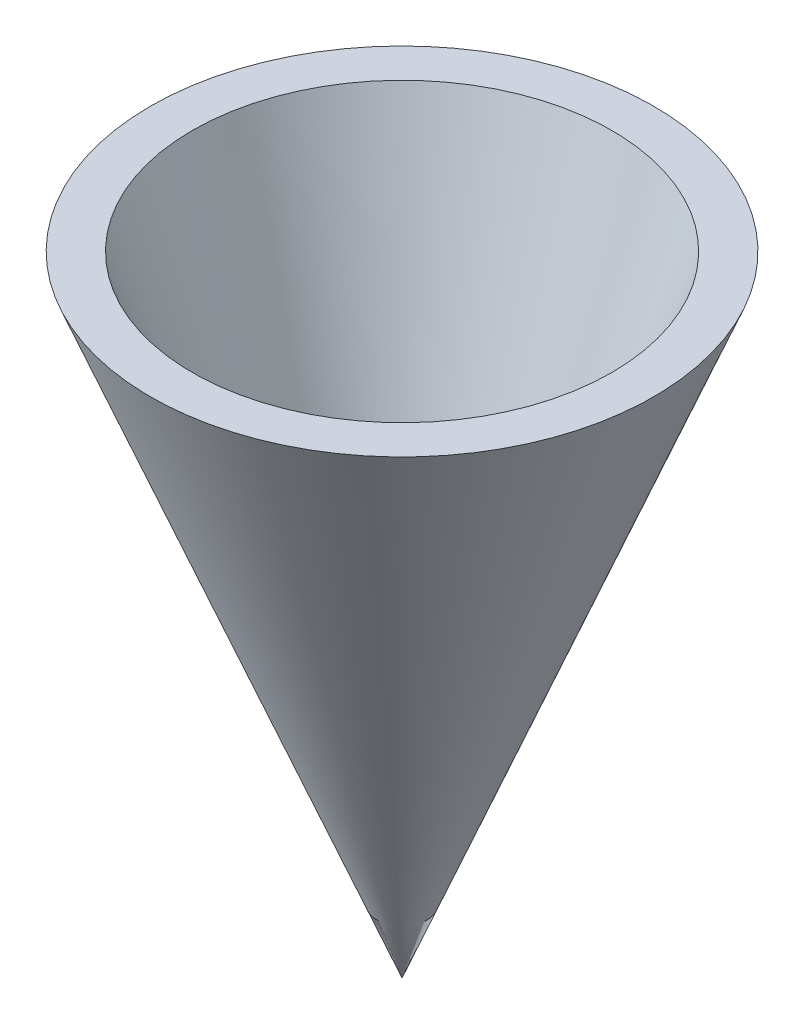
ISO-10303-21;
HEADER;
FILE_DESCRIPTION(('STEP AP214'),'2;1');
FILE_NAME('part.step','',(''),(''),'','','');
FILE_SCHEMA(('AUTOMOTIVE_DESIGN { 1 0 10303 214 1 1 1 1 }'));
ENDSEC;
DATA;
#1=APPLICATION_CONTEXT('core data for automotive mechanical design processes');
#2=APPLICATION_PROTOCOL_DEFINITION('international standard','automotive_design',2000,#1);
#3=PRODUCT_CONTEXT('',#1,'mechanical');
#4=PRODUCT('Part','Part','',(#3));
#5=PRODUCT_RELATED_PRODUCT_CATEGORY('part','',(#4));
#6=PRODUCT_DEFINITION_FORMATION('','',#4);
#7=PRODUCT_DEFINITION_CONTEXT('part definition',#1,'design');
#8=PRODUCT_DEFINITION('design','',#6,#7);
#9=PRODUCT_DEFINITION_SHAPE('','',#8);
#10=(LENGTH_UNIT() NAMED_UNIT(*) SI_UNIT(.MILLI.,.METRE.));
#11=(NAMED_UNIT(*) PLANE_ANGLE_UNIT() SI_UNIT($,.RADIAN.));
#12=(NAMED_UNIT(*) SI_UNIT($,.STERADIAN.) SOLID_ANGLE_UNIT());
#13=UNCERTAINTY_MEASURE_WITH_UNIT(LENGTH_MEASURE(1.E-05),#10,'distance_accuracy_value','');
#14=(GEOMETRIC_REPRESENTATION_CONTEXT(3) GLOBAL_UNCERTAINTY_ASSIGNED_CONTEXT((#13)) GLOBAL_UNIT_ASSIGNED_CONTEXT((#10,
#11,#12)) REPRESENTATION_CONTEXT('',''));
#15=CARTESIAN_POINT('',(0.,0.,0.));
#16=DIRECTION('',(0.,0.,1.));
#17=DIRECTION('',(1.,0.,0.));
#18=AXIS2_PLACEMENT_3D('',#15,#16,#17);
#19=CARTESIAN_POINT('',(0.,0.,0.));
#20=DIRECTION('',(0.,1.,0.));
#21=DIRECTION('',(-1.,0.,0.));
#22=AXIS2_PLACEMENT_3D('',#19,#20,#21);
#23=CONICAL_SURFACE('',#22,12.,0.380506377112365);
#24=CARTESIAN_POINT('',(0.,-30.,0.));
#25=VERTEX_POINT('',#24);
#26=VERTEX_LOOP('',#25);
#27=FACE_BOUND('',#26,.T.);
#28=CARTESIAN_POINT('',(0.,0.,0.));
#29=DIRECTION('',(0.,1.,0.));
#30=DIRECTION('',(-1.,0.,0.));
#31=AXIS2_PLACEMENT_3D('',#28,#29,#30);
#32=CIRCLE('',#31,12.);
#33=CARTESIAN_POINT('',(-12.,0.,0.));
#34=VERTEX_POINT('',#33);
#35=EDGE_CURVE('E11',#34,#34,#32,.T.);
#36=ORIENTED_EDGE('',*,*,#35,.F.);
#37=EDGE_LOOP('',(#36));
#38=FACE_BOUND('',#37,.T.);
#39=ADVANCED_FACE('F35',(#27,#38),#23,.T.);
#40=CARTESIAN_POINT('',(-10.,0.,0.));
#41=DIRECTION('',(0.,1.,0.));
#42=DIRECTION('',(-1.,0.,0.));
#43=AXIS2_PLACEMENT_3D('',#40,#41,#42);
#44=PLANE('',#43);
#45=ORIENTED_EDGE('',*,*,#35,.T.);
#46=EDGE_LOOP('',(#45));
#47=FACE_BOUND('',#46,.T.);
#48=CARTESIAN_POINT('',(0.,0.,0.));
#49=DIRECTION('',(0.,1.,0.));
#50=DIRECTION('',(-1.,0.,0.));
#51=AXIS2_PLACEMENT_3D('',#48,#49,#50);
#52=CIRCLE('',#51,10.);
#53=CARTESIAN_POINT('',(-10.,0.,0.));
#54=VERTEX_POINT('',#53);
#55=EDGE_CURVE('E42',#54,#54,#52,.T.);
#56=ORIENTED_EDGE('',*,*,#55,.F.);
#57=EDGE_LOOP('',(#56));
#58=FACE_BOUND('',#57,.T.);
#59=ADVANCED_FACE('F50',(#47,#58),#44,.T.);
#60=CARTESIAN_POINT('',(0.,-20.929694616121,0.));
#61=DIRECTION('',(0.,1.,0.));
#62=DIRECTION('',(-1.,0.,0.));
#63=AXIS2_PLACEMENT_3D('',#60,#61,#62);
#64=CONICAL_SURFACE('',#63,3.02343512795968,0.321750554396642);
#65=ORIENTED_EDGE('',*,*,#55,.T.);
#66=EDGE_LOOP('',(#65));
#67=FACE_BOUND('',#66,.T.);
#68=CARTESIAN_POINT('',(0.,-20.929694616121,0.));
#69=DIRECTION('',(0.,1.,0.));
#70=DIRECTION('',(-1.,0.,0.));
#71=AXIS2_PLACEMENT_3D('',#68,#69,#70);
#72=CIRCLE('',#71,3.02343512795968);
#73=CARTESIAN_POINT('',(-3.02343512795968,-20.929694616121,0.));
#74=VERTEX_POINT('',#73);
#75=EDGE_CURVE('E59',#74,#74,#72,.T.);
#76=ORIENTED_EDGE('',*,*,#75,.F.);
#77=EDGE_LOOP('',(#76));
#78=FACE_BOUND('',#77,.T.);
#79=ADVANCED_FACE('F55',(#67,#78),#64,.F.);
#80=CARTESIAN_POINT('',(0.,-25.4648473080605,0.));
#81=DIRECTION('',(0.,1.,0.));
#82=DIRECTION('',(-1.,0.,0.));
#83=AXIS2_PLACEMENT_3D('',#80,#81,#82);
#84=CONICAL_SURFACE('',#83,0.,0.588002603547568);
#85=ORIENTED_EDGE('',*,*,#75,.T.);
#86=EDGE_LOOP('',(#85));
#87=FACE_BOUND('',#86,.T.);
#88=CARTESIAN_POINT('',(0.,-25.4648473080605,0.));
#89=VERTEX_POINT('',#88);
#90=VERTEX_LOOP('',#89);
#91=FACE_BOUND('',#90,.T.);
#92=ADVANCED_FACE('F64',(#87,#91),#84,.F.);
#93=CLOSED_SHELL('',(#39,#59,#79,#92));
#94=MANIFOLD_SOLID_BREP('B2',#93);
#95=ADVANCED_BREP_SHAPE_REPRESENTATION('',(#18,#94),#14);
#96=SHAPE_DEFINITION_REPRESENTATION(#9,#95);
ENDSEC;
END-ISO-10303-21;
